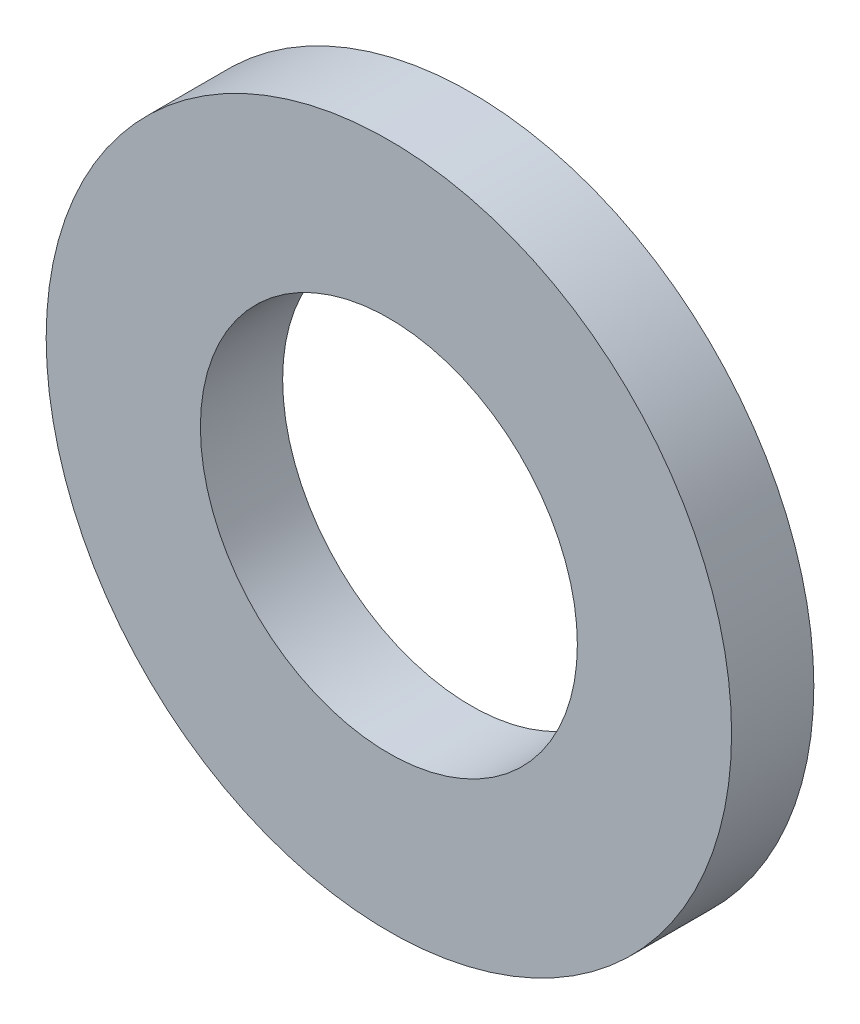
ISO-10303-21;
HEADER;
FILE_DESCRIPTION(('STEP AP214'),'2;1');
FILE_NAME('part.step','',(''),(''),'','','');
FILE_SCHEMA(('AUTOMOTIVE_DESIGN { 1 0 10303 214 1 1 1 1 }'));
ENDSEC;
DATA;
#1=APPLICATION_CONTEXT('core data for automotive mechanical design processes');
#2=APPLICATION_PROTOCOL_DEFINITION('international standard','automotive_design',2000,#1);
#3=PRODUCT_CONTEXT('',#1,'mechanical');
#4=PRODUCT('Part','Part','',(#3));
#5=PRODUCT_RELATED_PRODUCT_CATEGORY('part','',(#4));
#6=PRODUCT_DEFINITION_FORMATION('','',#4);
#7=PRODUCT_DEFINITION_CONTEXT('part definition',#1,'design');
#8=PRODUCT_DEFINITION('design','',#6,#7);
#9=PRODUCT_DEFINITION_SHAPE('','',#8);
#10=(LENGTH_UNIT() NAMED_UNIT(*) SI_UNIT(.MILLI.,.METRE.));
#11=(NAMED_UNIT(*) PLANE_ANGLE_UNIT() SI_UNIT($,.RADIAN.));
#12=(NAMED_UNIT(*) SI_UNIT($,.STERADIAN.) SOLID_ANGLE_UNIT());
#13=UNCERTAINTY_MEASURE_WITH_UNIT(LENGTH_MEASURE(1.E-05),#10,'distance_accuracy_value','');
#14=(GEOMETRIC_REPRESENTATION_CONTEXT(3) GLOBAL_UNCERTAINTY_ASSIGNED_CONTEXT((#13)) GLOBAL_UNIT_ASSIGNED_CONTEXT((#10,
#11,#12)) REPRESENTATION_CONTEXT('',''));
#15=CARTESIAN_POINT('',(0.,0.,0.));
#16=DIRECTION('',(0.,0.,1.));
#17=DIRECTION('',(1.,0.,0.));
#18=AXIS2_PLACEMENT_3D('',#15,#16,#17);
#19=CARTESIAN_POINT('',(0.,0.,1.19999999999998));
#20=DIRECTION('',(0.,0.,1.));
#21=DIRECTION('',(1.,0.,0.));
#22=AXIS2_PLACEMENT_3D('',#19,#20,#21);
#23=PLANE('',#22);
#24=CARTESIAN_POINT('',(0.,0.,1.19999999999998));
#25=DIRECTION('',(0.,0.,1.));
#26=DIRECTION('',(1.,0.,0.));
#27=AXIS2_PLACEMENT_3D('',#24,#25,#26);
#28=CIRCLE('',#27,5.);
#29=CARTESIAN_POINT('',(5.,0.,1.19999999999998));
#30=VERTEX_POINT('',#29);
#31=EDGE_CURVE('E10',#30,#30,#28,.T.);
#32=ORIENTED_EDGE('',*,*,#31,.T.);
#33=EDGE_LOOP('',(#32));
#34=FACE_BOUND('',#33,.T.);
#35=CARTESIAN_POINT('',(0.,0.,1.19999999999998));
#36=DIRECTION('',(0.,0.,1.));
#37=DIRECTION('',(1.,0.,0.));
#38=AXIS2_PLACEMENT_3D('',#35,#36,#37);
#39=CIRCLE('',#38,2.75);
#40=CARTESIAN_POINT('',(2.75,0.,1.19999999999998));
#41=VERTEX_POINT('',#40);
#42=EDGE_CURVE('E43',#41,#41,#39,.T.);
#43=ORIENTED_EDGE('',*,*,#42,.F.);
#44=EDGE_LOOP('',(#43));
#45=FACE_BOUND('',#44,.T.);
#46=ADVANCED_FACE('F32',(#34,#45),#23,.T.);
#47=CARTESIAN_POINT('',(0.,0.,0.));
#48=DIRECTION('',(0.,0.,1.));
#49=DIRECTION('',(1.,0.,0.));
#50=AXIS2_PLACEMENT_3D('',#47,#48,#49);
#51=PLANE('',#50);
#52=CARTESIAN_POINT('',(0.,0.,0.));
#53=DIRECTION('',(0.,0.,1.));
#54=DIRECTION('',(1.,0.,0.));
#55=AXIS2_PLACEMENT_3D('',#52,#53,#54);
#56=CIRCLE('',#55,5.);
#57=CARTESIAN_POINT('',(5.,0.,0.));
#58=VERTEX_POINT('',#57);
#59=EDGE_CURVE('E36',#58,#58,#56,.T.);
#60=ORIENTED_EDGE('',*,*,#59,.F.);
#61=EDGE_LOOP('',(#60));
#62=FACE_BOUND('',#61,.T.);
#63=CARTESIAN_POINT('',(0.,0.,0.));
#64=DIRECTION('',(0.,0.,1.));
#65=DIRECTION('',(1.,0.,0.));
#66=AXIS2_PLACEMENT_3D('',#63,#64,#65);
#67=CIRCLE('',#66,2.75);
#68=CARTESIAN_POINT('',(2.75,0.,0.));
#69=VERTEX_POINT('',#68);
#70=EDGE_CURVE('E45',#69,#69,#67,.T.);
#71=ORIENTED_EDGE('',*,*,#70,.T.);
#72=EDGE_LOOP('',(#71));
#73=FACE_BOUND('',#72,.T.);
#74=ADVANCED_FACE('F55',(#62,#73),#51,.F.);
#75=CARTESIAN_POINT('',(0.,0.,1.19999999999998));
#76=DIRECTION('',(0.,0.,-1.));
#77=DIRECTION('',(-1.,0.,0.));
#78=AXIS2_PLACEMENT_3D('',#75,#76,#77);
#79=CYLINDRICAL_SURFACE('',#78,5.);
#80=ORIENTED_EDGE('',*,*,#31,.F.);
#81=EDGE_LOOP('',(#80));
#82=FACE_BOUND('',#81,.T.);
#83=ORIENTED_EDGE('',*,*,#59,.T.);
#84=EDGE_LOOP('',(#83));
#85=FACE_BOUND('',#84,.T.);
#86=ADVANCED_FACE('F34',(#82,#85),#79,.T.);
#87=CARTESIAN_POINT('',(0.,0.,1.19999999999998));
#88=DIRECTION('',(0.,0.,-1.));
#89=DIRECTION('',(-1.,0.,0.));
#90=AXIS2_PLACEMENT_3D('',#87,#88,#89);
#91=CYLINDRICAL_SURFACE('',#90,2.75);
#92=ORIENTED_EDGE('',*,*,#42,.T.);
#93=EDGE_LOOP('',(#92));
#94=FACE_BOUND('',#93,.T.);
#95=ORIENTED_EDGE('',*,*,#70,.F.);
#96=EDGE_LOOP('',(#95));
#97=FACE_BOUND('',#96,.T.);
#98=ADVANCED_FACE('F51',(#94,#97),#91,.F.);
#99=CLOSED_SHELL('',(#46,#74,#86,#98));
#100=MANIFOLD_SOLID_BREP('B2',#99);
#101=ADVANCED_BREP_SHAPE_REPRESENTATION('',(#18,#100),#14);
#102=SHAPE_DEFINITION_REPRESENTATION(#9,#101);
ENDSEC;
END-ISO-10303-21;
